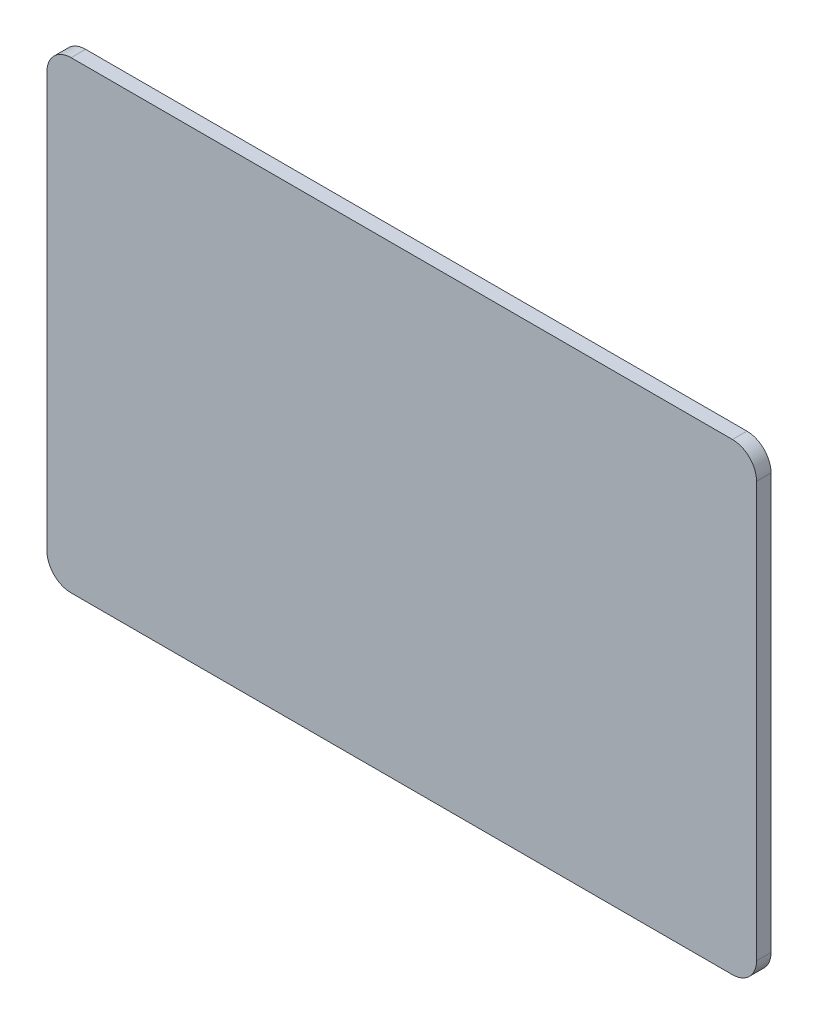
ISO-10303-21;
HEADER;
FILE_DESCRIPTION(('STEP AP214'),'2;1');
FILE_NAME('part.step','',(''),(''),'','','');
FILE_SCHEMA(('AUTOMOTIVE_DESIGN { 1 0 10303 214 1 1 1 1 }'));
ENDSEC;
DATA;
#1=APPLICATION_CONTEXT('core data for automotive mechanical design processes');
#2=APPLICATION_PROTOCOL_DEFINITION('international standard','automotive_design',2000,#1);
#3=PRODUCT_CONTEXT('',#1,'mechanical');
#4=PRODUCT('Part','Part','',(#3));
#5=PRODUCT_RELATED_PRODUCT_CATEGORY('part','',(#4));
#6=PRODUCT_DEFINITION_FORMATION('','',#4);
#7=PRODUCT_DEFINITION_CONTEXT('part definition',#1,'design');
#8=PRODUCT_DEFINITION('design','',#6,#7);
#9=PRODUCT_DEFINITION_SHAPE('','',#8);
#10=(LENGTH_UNIT() NAMED_UNIT(*) SI_UNIT(.MILLI.,.METRE.));
#11=(NAMED_UNIT(*) PLANE_ANGLE_UNIT() SI_UNIT($,.RADIAN.));
#12=(NAMED_UNIT(*) SI_UNIT($,.STERADIAN.) SOLID_ANGLE_UNIT());
#13=UNCERTAINTY_MEASURE_WITH_UNIT(LENGTH_MEASURE(1.E-05),#10,'distance_accuracy_value','');
#14=(GEOMETRIC_REPRESENTATION_CONTEXT(3) GLOBAL_UNCERTAINTY_ASSIGNED_CONTEXT((#13)) GLOBAL_UNIT_ASSIGNED_CONTEXT((#10,
#11,#12)) REPRESENTATION_CONTEXT('',''));
#15=CARTESIAN_POINT('',(0.,0.,0.));
#16=DIRECTION('',(0.,0.,1.));
#17=DIRECTION('',(1.,0.,0.));
#18=AXIS2_PLACEMENT_3D('',#15,#16,#17);
#19=CARTESIAN_POINT('',(293.974322668553,429.992677664877,0.));
#20=DIRECTION('',(0.,0.,-1.));
#21=DIRECTION('',(-1.,0.,0.));
#22=AXIS2_PLACEMENT_3D('',#19,#20,#21);
#23=PLANE('',#22);
#24=CARTESIAN_POINT('',(293.974322668553,429.992677664877,0.));
#25=DIRECTION('',(0.,0.,1.));
#26=DIRECTION('',(-1.,0.,0.));
#27=AXIS2_PLACEMENT_3D('',#24,#25,#26);
#28=CIRCLE('',#27,50.);
#29=CARTESIAN_POINT('',(343.974322668553,429.992677664876,0.));
#30=VERTEX_POINT('',#29);
#31=CARTESIAN_POINT('',(293.974322668553,479.992677664877,0.));
#32=VERTEX_POINT('',#31);
#33=EDGE_CURVE('E144',#30,#32,#28,.T.);
#34=ORIENTED_EDGE('',*,*,#33,.F.);
#35=DIRECTION('',(0.,1.,0.));
#36=VECTOR('',#35,1.);
#37=CARTESIAN_POINT('',(343.974322668553,429.992677664876,0.));
#38=LINE('',#37,#36);
#39=CARTESIAN_POINT('',(343.974322668553,-429.992677664877,0.));
#40=VERTEX_POINT('',#39);
#41=EDGE_CURVE('E92',#40,#30,#38,.T.);
#42=ORIENTED_EDGE('',*,*,#41,.F.);
#43=CARTESIAN_POINT('',(293.974322668553,-429.992677664877,0.));
#44=DIRECTION('',(0.,0.,1.));
#45=DIRECTION('',(1.,0.,0.));
#46=AXIS2_PLACEMENT_3D('',#43,#44,#45);
#47=CIRCLE('',#46,50.);
#48=CARTESIAN_POINT('',(293.974322668553,-479.992677664877,0.));
#49=VERTEX_POINT('',#48);
#50=EDGE_CURVE('E157',#49,#40,#47,.T.);
#51=ORIENTED_EDGE('',*,*,#50,.F.);
#52=DIRECTION('',(1.,0.,0.));
#53=VECTOR('',#52,1.);
#54=CARTESIAN_POINT('',(-1075.54837365518,-479.992677664877,0.));
#55=LINE('',#54,#53);
#56=CARTESIAN_POINT('',(-1075.54837365518,-479.992677664877,0.));
#57=VERTEX_POINT('',#56);
#58=EDGE_CURVE('E132',#57,#49,#55,.T.);
#59=ORIENTED_EDGE('',*,*,#58,.F.);
#60=CARTESIAN_POINT('',(-1075.54837365518,-429.992677664877,0.));
#61=DIRECTION('',(0.,0.,1.));
#62=DIRECTION('',(1.,0.,0.));
#63=AXIS2_PLACEMENT_3D('',#60,#61,#62);
#64=CIRCLE('',#63,50.);
#65=CARTESIAN_POINT('',(-1125.54837365518,-429.992677664876,0.));
#66=VERTEX_POINT('',#65);
#67=EDGE_CURVE('E154',#66,#57,#64,.T.);
#68=ORIENTED_EDGE('',*,*,#67,.F.);
#69=DIRECTION('',(0.,-1.,0.));
#70=VECTOR('',#69,1.);
#71=CARTESIAN_POINT('',(-1125.54837365518,429.992677664876,0.));
#72=LINE('',#71,#70);
#73=CARTESIAN_POINT('',(-1125.54837365518,429.992677664876,0.));
#74=VERTEX_POINT('',#73);
#75=EDGE_CURVE('E152',#74,#66,#72,.T.);
#76=ORIENTED_EDGE('',*,*,#75,.F.);
#77=CARTESIAN_POINT('',(-1075.54837365518,429.992677664877,0.));
#78=DIRECTION('',(0.,0.,1.));
#79=DIRECTION('',(1.,0.,0.));
#80=AXIS2_PLACEMENT_3D('',#77,#78,#79);
#81=CIRCLE('',#80,50.);
#82=CARTESIAN_POINT('',(-1075.54837365518,479.992677664877,0.));
#83=VERTEX_POINT('',#82);
#84=EDGE_CURVE('E150',#83,#74,#81,.T.);
#85=ORIENTED_EDGE('',*,*,#84,.F.);
#86=DIRECTION('',(-1.,0.,0.));
#87=VECTOR('',#86,1.);
#88=CARTESIAN_POINT('',(-1075.54837365518,479.992677664877,0.));
#89=LINE('',#88,#87);
#90=EDGE_CURVE('E147',#32,#83,#89,.T.);
#91=ORIENTED_EDGE('',*,*,#90,.F.);
#92=EDGE_LOOP('',(#34,#42,#51,#59,#68,#76,#85,#91));
#93=FACE_BOUND('',#92,.T.);
#94=DIRECTION('',(1.,0.,0.));
#95=VECTOR('',#94,1.);
#96=CARTESIAN_POINT('',(-510.,200.,0.));
#97=LINE('',#96,#95);
#98=CARTESIAN_POINT('',(-810.,200.,0.));
#99=VERTEX_POINT('',#98);
#100=CARTESIAN_POINT('',(-510.,200.,0.));
#101=VERTEX_POINT('',#100);
#102=EDGE_CURVE('E232',#99,#101,#97,.T.);
#103=ORIENTED_EDGE('',*,*,#102,.F.);
#104=CARTESIAN_POINT('',(-810.,150.,0.));
#105=DIRECTION('',(0.,0.,-1.));
#106=DIRECTION('',(1.,0.,0.));
#107=AXIS2_PLACEMENT_3D('',#104,#105,#106);
#108=CIRCLE('',#107,50.);
#109=CARTESIAN_POINT('',(-860.,150.,0.));
#110=VERTEX_POINT('',#109);
#111=EDGE_CURVE('E235',#110,#99,#108,.T.);
#112=ORIENTED_EDGE('',*,*,#111,.F.);
#113=DIRECTION('',(0.,1.,0.));
#114=VECTOR('',#113,1.);
#115=CARTESIAN_POINT('',(-860.,150.,0.));
#116=LINE('',#115,#114);
#117=CARTESIAN_POINT('',(-860.,-150.,0.));
#118=VERTEX_POINT('',#117);
#119=EDGE_CURVE('E215',#118,#110,#116,.T.);
#120=ORIENTED_EDGE('',*,*,#119,.F.);
#121=CARTESIAN_POINT('',(-810.,-150.,0.));
#122=DIRECTION('',(0.,0.,-1.));
#123=DIRECTION('',(-1.,0.,0.));
#124=AXIS2_PLACEMENT_3D('',#121,#122,#123);
#125=CIRCLE('',#124,50.0000000000001);
#126=CARTESIAN_POINT('',(-810.,-200.,0.));
#127=VERTEX_POINT('',#126);
#128=EDGE_CURVE('E218',#127,#118,#125,.T.);
#129=ORIENTED_EDGE('',*,*,#128,.F.);
#130=DIRECTION('',(-1.,0.,0.));
#131=VECTOR('',#130,1.);
#132=CARTESIAN_POINT('',(-510.,-200.,0.));
#133=LINE('',#132,#131);
#134=CARTESIAN_POINT('',(-510.,-200.,0.));
#135=VERTEX_POINT('',#134);
#136=EDGE_CURVE('E220',#135,#127,#133,.T.);
#137=ORIENTED_EDGE('',*,*,#136,.F.);
#138=CARTESIAN_POINT('',(-510.,-150.,0.));
#139=DIRECTION('',(0.,0.,-1.));
#140=DIRECTION('',(-1.,0.,0.));
#141=AXIS2_PLACEMENT_3D('',#138,#139,#140);
#142=CIRCLE('',#141,50.);
#143=CARTESIAN_POINT('',(-460.,-150.,0.));
#144=VERTEX_POINT('',#143);
#145=EDGE_CURVE('E223',#144,#135,#142,.T.);
#146=ORIENTED_EDGE('',*,*,#145,.F.);
#147=DIRECTION('',(0.,-1.,0.));
#148=VECTOR('',#147,1.);
#149=CARTESIAN_POINT('',(-460.,150.,0.));
#150=LINE('',#149,#148);
#151=CARTESIAN_POINT('',(-460.,150.,0.));
#152=VERTEX_POINT('',#151);
#153=EDGE_CURVE('E226',#152,#144,#150,.T.);
#154=ORIENTED_EDGE('',*,*,#153,.F.);
#155=CARTESIAN_POINT('',(-510.,150.,0.));
#156=DIRECTION('',(0.,0.,-1.));
#157=DIRECTION('',(-1.,0.,0.));
#158=AXIS2_PLACEMENT_3D('',#155,#156,#157);
#159=CIRCLE('',#158,50.);
#160=EDGE_CURVE('E229',#101,#152,#159,.T.);
#161=ORIENTED_EDGE('',*,*,#160,.F.);
#162=EDGE_LOOP('',(#103,#112,#120,#129,#137,#146,#154,#161));
#163=FACE_BOUND('',#162,.T.);
#164=ADVANCED_FACE('F35',(#93,#163),#23,.T.);
#165=CARTESIAN_POINT('',(293.974322668553,429.992677664877,30.));
#166=DIRECTION('',(0.,0.,-1.));
#167=DIRECTION('',(-1.,0.,0.));
#168=AXIS2_PLACEMENT_3D('',#165,#166,#167);
#169=CYLINDRICAL_SURFACE('',#168,50.);
#170=ORIENTED_EDGE('',*,*,#33,.T.);
#171=DIRECTION('',(0.,0.,-1.));
#172=VECTOR('',#171,1.);
#173=CARTESIAN_POINT('',(293.974322668553,479.992677664877,30.));
#174=LINE('',#173,#172);
#175=CARTESIAN_POINT('',(293.974322668553,479.992677664877,30.));
#176=VERTEX_POINT('',#175);
#177=EDGE_CURVE('E11',#176,#32,#174,.T.);
#178=ORIENTED_EDGE('',*,*,#177,.F.);
#179=CARTESIAN_POINT('',(293.974322668553,429.992677664877,30.));
#180=DIRECTION('',(0.,0.,1.));
#181=DIRECTION('',(-1.,0.,0.));
#182=AXIS2_PLACEMENT_3D('',#179,#180,#181);
#183=CIRCLE('',#182,50.);
#184=CARTESIAN_POINT('',(343.974322668553,429.992677664876,30.));
#185=VERTEX_POINT('',#184);
#186=EDGE_CURVE('E160',#185,#176,#183,.T.);
#187=ORIENTED_EDGE('',*,*,#186,.F.);
#188=DIRECTION('',(0.,0.,-1.));
#189=VECTOR('',#188,1.);
#190=CARTESIAN_POINT('',(343.974322668553,429.992677664876,30.));
#191=LINE('',#190,#189);
#192=EDGE_CURVE('E140',#185,#30,#191,.T.);
#193=ORIENTED_EDGE('',*,*,#192,.T.);
#194=EDGE_LOOP('',(#170,#178,#187,#193));
#195=FACE_BOUND('',#194,.T.);
#196=ADVANCED_FACE('F37',(#195),#169,.T.);
#197=CARTESIAN_POINT('',(-1075.54837365518,479.992677664877,30.));
#198=DIRECTION('',(0.,-1.,0.));
#199=DIRECTION('',(0.,0.,-1.));
#200=AXIS2_PLACEMENT_3D('',#197,#198,#199);
#201=PLANE('',#200);
#202=ORIENTED_EDGE('',*,*,#90,.T.);
#203=DIRECTION('',(0.,0.,-1.));
#204=VECTOR('',#203,1.);
#205=CARTESIAN_POINT('',(-1075.54837365518,479.992677664877,30.));
#206=LINE('',#205,#204);
#207=CARTESIAN_POINT('',(-1075.54837365518,479.992677664877,30.));
#208=VERTEX_POINT('',#207);
#209=EDGE_CURVE('E43',#208,#83,#206,.T.);
#210=ORIENTED_EDGE('',*,*,#209,.F.);
#211=DIRECTION('',(-1.,0.,0.));
#212=VECTOR('',#211,1.);
#213=CARTESIAN_POINT('',(-1075.54837365518,479.992677664877,30.));
#214=LINE('',#213,#212);
#215=EDGE_CURVE('E100',#176,#208,#214,.T.);
#216=ORIENTED_EDGE('',*,*,#215,.F.);
#217=ORIENTED_EDGE('',*,*,#177,.T.);
#218=EDGE_LOOP('',(#202,#210,#216,#217));
#219=FACE_BOUND('',#218,.T.);
#220=ADVANCED_FACE('F337',(#219),#201,.F.);
#221=CARTESIAN_POINT('',(-1075.54837365518,429.992677664877,30.));
#222=DIRECTION('',(0.,0.,-1.));
#223=DIRECTION('',(-1.,0.,0.));
#224=AXIS2_PLACEMENT_3D('',#221,#222,#223);
#225=CYLINDRICAL_SURFACE('',#224,50.);
#226=ORIENTED_EDGE('',*,*,#84,.T.);
#227=DIRECTION('',(0.,0.,-1.));
#228=VECTOR('',#227,1.);
#229=CARTESIAN_POINT('',(-1125.54837365518,429.992677664876,30.));
#230=LINE('',#229,#228);
#231=CARTESIAN_POINT('',(-1125.54837365518,429.992677664876,30.));
#232=VERTEX_POINT('',#231);
#233=EDGE_CURVE('E167',#232,#74,#230,.T.);
#234=ORIENTED_EDGE('',*,*,#233,.F.);
#235=CARTESIAN_POINT('',(-1075.54837365518,429.992677664877,30.));
#236=DIRECTION('',(0.,0.,1.));
#237=DIRECTION('',(1.,0.,0.));
#238=AXIS2_PLACEMENT_3D('',#235,#236,#237);
#239=CIRCLE('',#238,50.);
#240=EDGE_CURVE('E175',#208,#232,#239,.T.);
#241=ORIENTED_EDGE('',*,*,#240,.F.);
#242=ORIENTED_EDGE('',*,*,#209,.T.);
#243=EDGE_LOOP('',(#226,#234,#241,#242));
#244=FACE_BOUND('',#243,.T.);
#245=ADVANCED_FACE('F173',(#244),#225,.T.);
#246=CARTESIAN_POINT('',(-1125.54837365518,429.992677664876,30.));
#247=DIRECTION('',(1.,0.,0.));
#248=DIRECTION('',(0.,0.,-1.));
#249=AXIS2_PLACEMENT_3D('',#246,#247,#248);
#250=PLANE('',#249);
#251=ORIENTED_EDGE('',*,*,#75,.T.);
#252=DIRECTION('',(0.,0.,-1.));
#253=VECTOR('',#252,1.);
#254=CARTESIAN_POINT('',(-1125.54837365518,-429.992677664876,30.));
#255=LINE('',#254,#253);
#256=CARTESIAN_POINT('',(-1125.54837365518,-429.992677664876,30.));
#257=VERTEX_POINT('',#256);
#258=EDGE_CURVE('E164',#257,#66,#255,.T.);
#259=ORIENTED_EDGE('',*,*,#258,.F.);
#260=DIRECTION('',(0.,-1.,0.));
#261=VECTOR('',#260,1.);
#262=CARTESIAN_POINT('',(-1125.54837365518,429.992677664876,30.));
#263=LINE('',#262,#261);
#264=EDGE_CURVE('E187',#232,#257,#263,.T.);
#265=ORIENTED_EDGE('',*,*,#264,.F.);
#266=ORIENTED_EDGE('',*,*,#233,.T.);
#267=EDGE_LOOP('',(#251,#259,#265,#266));
#268=FACE_BOUND('',#267,.T.);
#269=ADVANCED_FACE('F183',(#268),#250,.F.);
#270=CARTESIAN_POINT('',(-1075.54837365518,-429.992677664877,30.));
#271=DIRECTION('',(0.,0.,-1.));
#272=DIRECTION('',(-1.,0.,0.));
#273=AXIS2_PLACEMENT_3D('',#270,#271,#272);
#274=CYLINDRICAL_SURFACE('',#273,50.);
#275=ORIENTED_EDGE('',*,*,#67,.T.);
#276=DIRECTION('',(0.,0.,-1.));
#277=VECTOR('',#276,1.);
#278=CARTESIAN_POINT('',(-1075.54837365518,-479.992677664877,30.));
#279=LINE('',#278,#277);
#280=CARTESIAN_POINT('',(-1075.54837365518,-479.992677664877,30.));
#281=VERTEX_POINT('',#280);
#282=EDGE_CURVE('E135',#281,#57,#279,.T.);
#283=ORIENTED_EDGE('',*,*,#282,.F.);
#284=CARTESIAN_POINT('',(-1075.54837365518,-429.992677664877,30.));
#285=DIRECTION('',(0.,0.,1.));
#286=DIRECTION('',(1.,0.,0.));
#287=AXIS2_PLACEMENT_3D('',#284,#285,#286);
#288=CIRCLE('',#287,50.);
#289=EDGE_CURVE('E123',#257,#281,#288,.T.);
#290=ORIENTED_EDGE('',*,*,#289,.F.);
#291=ORIENTED_EDGE('',*,*,#258,.T.);
#292=EDGE_LOOP('',(#275,#283,#290,#291));
#293=FACE_BOUND('',#292,.T.);
#294=ADVANCED_FACE('F186',(#293),#274,.T.);
#295=CARTESIAN_POINT('',(-1075.54837365518,-479.992677664877,30.));
#296=DIRECTION('',(0.,1.,0.));
#297=DIRECTION('',(0.,0.,1.));
#298=AXIS2_PLACEMENT_3D('',#295,#296,#297);
#299=PLANE('',#298);
#300=ORIENTED_EDGE('',*,*,#58,.T.);
#301=DIRECTION('',(0.,0.,-1.));
#302=VECTOR('',#301,1.);
#303=CARTESIAN_POINT('',(293.974322668553,-479.992677664877,30.));
#304=LINE('',#303,#302);
#305=CARTESIAN_POINT('',(293.974322668553,-479.992677664877,30.));
#306=VERTEX_POINT('',#305);
#307=EDGE_CURVE('E129',#306,#49,#304,.T.);
#308=ORIENTED_EDGE('',*,*,#307,.F.);
#309=DIRECTION('',(1.,0.,0.));
#310=VECTOR('',#309,1.);
#311=CARTESIAN_POINT('',(-1075.54837365518,-479.992677664877,30.));
#312=LINE('',#311,#310);
#313=EDGE_CURVE('E116',#281,#306,#312,.T.);
#314=ORIENTED_EDGE('',*,*,#313,.F.);
#315=ORIENTED_EDGE('',*,*,#282,.T.);
#316=EDGE_LOOP('',(#300,#308,#314,#315));
#317=FACE_BOUND('',#316,.T.);
#318=ADVANCED_FACE('F130',(#317),#299,.F.);
#319=CARTESIAN_POINT('',(293.974322668553,-429.992677664877,30.));
#320=DIRECTION('',(0.,0.,-1.));
#321=DIRECTION('',(-1.,0.,0.));
#322=AXIS2_PLACEMENT_3D('',#319,#320,#321);
#323=CYLINDRICAL_SURFACE('',#322,50.);
#324=ORIENTED_EDGE('',*,*,#50,.T.);
#325=DIRECTION('',(0.,0.,-1.));
#326=VECTOR('',#325,1.);
#327=CARTESIAN_POINT('',(343.974322668553,-429.992677664877,30.));
#328=LINE('',#327,#326);
#329=CARTESIAN_POINT('',(343.974322668553,-429.992677664877,30.));
#330=VERTEX_POINT('',#329);
#331=EDGE_CURVE('E136',#330,#40,#328,.T.);
#332=ORIENTED_EDGE('',*,*,#331,.F.);
#333=CARTESIAN_POINT('',(293.974322668553,-429.992677664877,30.));
#334=DIRECTION('',(0.,0.,1.));
#335=DIRECTION('',(1.,0.,0.));
#336=AXIS2_PLACEMENT_3D('',#333,#334,#335);
#337=CIRCLE('',#336,50.);
#338=EDGE_CURVE('E120',#306,#330,#337,.T.);
#339=ORIENTED_EDGE('',*,*,#338,.F.);
#340=ORIENTED_EDGE('',*,*,#307,.T.);
#341=EDGE_LOOP('',(#324,#332,#339,#340));
#342=FACE_BOUND('',#341,.T.);
#343=ADVANCED_FACE('F138',(#342),#323,.T.);
#344=CARTESIAN_POINT('',(343.974322668553,429.992677664876,30.));
#345=DIRECTION('',(-1.,0.,0.));
#346=DIRECTION('',(0.,0.,1.));
#347=AXIS2_PLACEMENT_3D('',#344,#345,#346);
#348=PLANE('',#347);
#349=ORIENTED_EDGE('',*,*,#41,.T.);
#350=ORIENTED_EDGE('',*,*,#192,.F.);
#351=DIRECTION('',(0.,1.,0.));
#352=VECTOR('',#351,1.);
#353=CARTESIAN_POINT('',(343.974322668553,429.992677664876,30.));
#354=LINE('',#353,#352);
#355=EDGE_CURVE('E59',#330,#185,#354,.T.);
#356=ORIENTED_EDGE('',*,*,#355,.F.);
#357=ORIENTED_EDGE('',*,*,#331,.T.);
#358=EDGE_LOOP('',(#349,#350,#356,#357));
#359=FACE_BOUND('',#358,.T.);
#360=ADVANCED_FACE('F342',(#359),#348,.F.);
#361=CARTESIAN_POINT('',(293.974322668553,429.992677664877,30.));
#362=DIRECTION('',(0.,0.,-1.));
#363=DIRECTION('',(-1.,0.,0.));
#364=AXIS2_PLACEMENT_3D('',#361,#362,#363);
#365=PLANE('',#364);
#366=ORIENTED_EDGE('',*,*,#186,.T.);
#367=ORIENTED_EDGE('',*,*,#215,.T.);
#368=ORIENTED_EDGE('',*,*,#240,.T.);
#369=ORIENTED_EDGE('',*,*,#264,.T.);
#370=ORIENTED_EDGE('',*,*,#289,.T.);
#371=ORIENTED_EDGE('',*,*,#313,.T.);
#372=ORIENTED_EDGE('',*,*,#338,.T.);
#373=ORIENTED_EDGE('',*,*,#355,.T.);
#374=EDGE_LOOP('',(#366,#367,#368,#369,#370,#371,#372,#373));
#375=FACE_BOUND('',#374,.T.);
#376=ADVANCED_FACE('F118',(#375),#365,.F.);
#377=CARTESIAN_POINT('',(-810.,150.,-100.));
#378=DIRECTION('',(0.,0.,1.));
#379=DIRECTION('',(1.,0.,0.));
#380=AXIS2_PLACEMENT_3D('',#377,#378,#379);
#381=CYLINDRICAL_SURFACE('',#380,50.);
#382=ORIENTED_EDGE('',*,*,#111,.T.);
#383=DIRECTION('',(0.,0.,1.));
#384=VECTOR('',#383,1.);
#385=CARTESIAN_POINT('',(-810.,200.,-100.));
#386=LINE('',#385,#384);
#387=CARTESIAN_POINT('',(-810.,200.,-100.));
#388=VERTEX_POINT('',#387);
#389=EDGE_CURVE('E148',#388,#99,#386,.T.);
#390=ORIENTED_EDGE('',*,*,#389,.F.);
#391=CARTESIAN_POINT('',(-810.,150.,-100.));
#392=DIRECTION('',(0.,0.,-1.));
#393=DIRECTION('',(1.,0.,0.));
#394=AXIS2_PLACEMENT_3D('',#391,#392,#393);
#395=CIRCLE('',#394,50.);
#396=CARTESIAN_POINT('',(-860.,150.,-100.));
#397=VERTEX_POINT('',#396);
#398=EDGE_CURVE('E217',#397,#388,#395,.T.);
#399=ORIENTED_EDGE('',*,*,#398,.F.);
#400=DIRECTION('',(0.,0.,1.));
#401=VECTOR('',#400,1.);
#402=CARTESIAN_POINT('',(-860.,150.,-100.));
#403=LINE('',#402,#401);
#404=EDGE_CURVE('E211',#397,#110,#403,.T.);
#405=ORIENTED_EDGE('',*,*,#404,.T.);
#406=EDGE_LOOP('',(#382,#390,#399,#405));
#407=FACE_BOUND('',#406,.T.);
#408=ADVANCED_FACE('F270',(#407),#381,.T.);
#409=CARTESIAN_POINT('',(-510.,200.,-100.));
#410=DIRECTION('',(0.,-1.,0.));
#411=DIRECTION('',(1.,0.,0.));
#412=AXIS2_PLACEMENT_3D('',#409,#410,#411);
#413=PLANE('',#412);
#414=ORIENTED_EDGE('',*,*,#102,.T.);
#415=DIRECTION('',(0.,0.,1.));
#416=VECTOR('',#415,1.);
#417=CARTESIAN_POINT('',(-510.,200.,-100.));
#418=LINE('',#417,#416);
#419=CARTESIAN_POINT('',(-510.,200.,-100.));
#420=VERTEX_POINT('',#419);
#421=EDGE_CURVE('E195',#420,#101,#418,.T.);
#422=ORIENTED_EDGE('',*,*,#421,.F.);
#423=DIRECTION('',(1.,0.,0.));
#424=VECTOR('',#423,1.);
#425=CARTESIAN_POINT('',(-510.,200.,-100.));
#426=LINE('',#425,#424);
#427=EDGE_CURVE('E255',#388,#420,#426,.T.);
#428=ORIENTED_EDGE('',*,*,#427,.F.);
#429=ORIENTED_EDGE('',*,*,#389,.T.);
#430=EDGE_LOOP('',(#414,#422,#428,#429));
#431=FACE_BOUND('',#430,.T.);
#432=ADVANCED_FACE('F275',(#431),#413,.F.);
#433=CARTESIAN_POINT('',(-510.,150.,-100.));
#434=DIRECTION('',(0.,0.,1.));
#435=DIRECTION('',(1.,0.,0.));
#436=AXIS2_PLACEMENT_3D('',#433,#434,#435);
#437=CYLINDRICAL_SURFACE('',#436,50.);
#438=ORIENTED_EDGE('',*,*,#160,.T.);
#439=DIRECTION('',(0.,0.,1.));
#440=VECTOR('',#439,1.);
#441=CARTESIAN_POINT('',(-460.,150.,-100.));
#442=LINE('',#441,#440);
#443=CARTESIAN_POINT('',(-460.,150.,-100.));
#444=VERTEX_POINT('',#443);
#445=EDGE_CURVE('E198',#444,#152,#442,.T.);
#446=ORIENTED_EDGE('',*,*,#445,.F.);
#447=CARTESIAN_POINT('',(-510.,150.,-100.));
#448=DIRECTION('',(0.,0.,-1.));
#449=DIRECTION('',(-1.,0.,0.));
#450=AXIS2_PLACEMENT_3D('',#447,#448,#449);
#451=CIRCLE('',#450,50.);
#452=EDGE_CURVE('E252',#420,#444,#451,.T.);
#453=ORIENTED_EDGE('',*,*,#452,.F.);
#454=ORIENTED_EDGE('',*,*,#421,.T.);
#455=EDGE_LOOP('',(#438,#446,#453,#454));
#456=FACE_BOUND('',#455,.T.);
#457=ADVANCED_FACE('F299',(#456),#437,.T.);
#458=CARTESIAN_POINT('',(-460.,150.,-100.));
#459=DIRECTION('',(-1.,0.,0.));
#460=DIRECTION('',(0.,-1.,0.));
#461=AXIS2_PLACEMENT_3D('',#458,#459,#460);
#462=PLANE('',#461);
#463=ORIENTED_EDGE('',*,*,#153,.T.);
#464=DIRECTION('',(0.,0.,1.));
#465=VECTOR('',#464,1.);
#466=CARTESIAN_POINT('',(-460.,-150.,-100.));
#467=LINE('',#466,#465);
#468=CARTESIAN_POINT('',(-460.,-150.,-100.));
#469=VERTEX_POINT('',#468);
#470=EDGE_CURVE('E201',#469,#144,#467,.T.);
#471=ORIENTED_EDGE('',*,*,#470,.F.);
#472=DIRECTION('',(0.,-1.,0.));
#473=VECTOR('',#472,1.);
#474=CARTESIAN_POINT('',(-460.,150.,-100.));
#475=LINE('',#474,#473);
#476=EDGE_CURVE('E249',#444,#469,#475,.T.);
#477=ORIENTED_EDGE('',*,*,#476,.F.);
#478=ORIENTED_EDGE('',*,*,#445,.T.);
#479=EDGE_LOOP('',(#463,#471,#477,#478));
#480=FACE_BOUND('',#479,.T.);
#481=ADVANCED_FACE('F304',(#480),#462,.F.);
#482=CARTESIAN_POINT('',(-510.,-150.,-100.));
#483=DIRECTION('',(0.,0.,1.));
#484=DIRECTION('',(1.,0.,0.));
#485=AXIS2_PLACEMENT_3D('',#482,#483,#484);
#486=CYLINDRICAL_SURFACE('',#485,50.);
#487=ORIENTED_EDGE('',*,*,#145,.T.);
#488=DIRECTION('',(0.,0.,1.));
#489=VECTOR('',#488,1.);
#490=CARTESIAN_POINT('',(-510.,-200.,-100.));
#491=LINE('',#490,#489);
#492=CARTESIAN_POINT('',(-510.,-200.,-100.));
#493=VERTEX_POINT('',#492);
#494=EDGE_CURVE('E204',#493,#135,#491,.T.);
#495=ORIENTED_EDGE('',*,*,#494,.F.);
#496=CARTESIAN_POINT('',(-510.,-150.,-100.));
#497=DIRECTION('',(0.,0.,-1.));
#498=DIRECTION('',(-1.,0.,0.));
#499=AXIS2_PLACEMENT_3D('',#496,#497,#498);
#500=CIRCLE('',#499,50.);
#501=EDGE_CURVE('E246',#469,#493,#500,.T.);
#502=ORIENTED_EDGE('',*,*,#501,.F.);
#503=ORIENTED_EDGE('',*,*,#470,.T.);
#504=EDGE_LOOP('',(#487,#495,#502,#503));
#505=FACE_BOUND('',#504,.T.);
#506=ADVANCED_FACE('F322',(#505),#486,.T.);
#507=CARTESIAN_POINT('',(-510.,-200.,-100.));
#508=DIRECTION('',(0.,1.,0.));
#509=DIRECTION('',(-1.,0.,0.));
#510=AXIS2_PLACEMENT_3D('',#507,#508,#509);
#511=PLANE('',#510);
#512=ORIENTED_EDGE('',*,*,#136,.T.);
#513=DIRECTION('',(0.,0.,1.));
#514=VECTOR('',#513,1.);
#515=CARTESIAN_POINT('',(-810.,-200.,-100.));
#516=LINE('',#515,#514);
#517=CARTESIAN_POINT('',(-810.,-200.,-100.));
#518=VERTEX_POINT('',#517);
#519=EDGE_CURVE('E207',#518,#127,#516,.T.);
#520=ORIENTED_EDGE('',*,*,#519,.F.);
#521=DIRECTION('',(-1.,0.,0.));
#522=VECTOR('',#521,1.);
#523=CARTESIAN_POINT('',(-510.,-200.,-100.));
#524=LINE('',#523,#522);
#525=EDGE_CURVE('E243',#493,#518,#524,.T.);
#526=ORIENTED_EDGE('',*,*,#525,.F.);
#527=ORIENTED_EDGE('',*,*,#494,.T.);
#528=EDGE_LOOP('',(#512,#520,#526,#527));
#529=FACE_BOUND('',#528,.T.);
#530=ADVANCED_FACE('F323',(#529),#511,.F.);
#531=CARTESIAN_POINT('',(-810.,-150.,-100.));
#532=DIRECTION('',(0.,0.,1.));
#533=DIRECTION('',(1.,0.,0.));
#534=AXIS2_PLACEMENT_3D('',#531,#532,#533);
#535=CYLINDRICAL_SURFACE('',#534,50.0000000000001);
#536=ORIENTED_EDGE('',*,*,#128,.T.);
#537=DIRECTION('',(0.,0.,1.));
#538=VECTOR('',#537,1.);
#539=CARTESIAN_POINT('',(-860.,-150.,-100.));
#540=LINE('',#539,#538);
#541=CARTESIAN_POINT('',(-860.,-150.,-100.));
#542=VERTEX_POINT('',#541);
#543=EDGE_CURVE('E50',#542,#118,#540,.T.);
#544=ORIENTED_EDGE('',*,*,#543,.F.);
#545=CARTESIAN_POINT('',(-810.,-150.,-100.));
#546=DIRECTION('',(0.,0.,-1.));
#547=DIRECTION('',(-1.,0.,0.));
#548=AXIS2_PLACEMENT_3D('',#545,#546,#547);
#549=CIRCLE('',#548,50.0000000000001);
#550=EDGE_CURVE('E240',#518,#542,#549,.T.);
#551=ORIENTED_EDGE('',*,*,#550,.F.);
#552=ORIENTED_EDGE('',*,*,#519,.T.);
#553=EDGE_LOOP('',(#536,#544,#551,#552));
#554=FACE_BOUND('',#553,.T.);
#555=ADVANCED_FACE('F320',(#554),#535,.T.);
#556=CARTESIAN_POINT('',(-860.,150.,-100.));
#557=DIRECTION('',(1.,0.,0.));
#558=DIRECTION('',(0.,1.,0.));
#559=AXIS2_PLACEMENT_3D('',#556,#557,#558);
#560=PLANE('',#559);
#561=ORIENTED_EDGE('',*,*,#119,.T.);
#562=ORIENTED_EDGE('',*,*,#404,.F.);
#563=DIRECTION('',(0.,1.,0.));
#564=VECTOR('',#563,1.);
#565=CARTESIAN_POINT('',(-860.,150.,-100.));
#566=LINE('',#565,#564);
#567=EDGE_CURVE('E214',#542,#397,#566,.T.);
#568=ORIENTED_EDGE('',*,*,#567,.F.);
#569=ORIENTED_EDGE('',*,*,#543,.T.);
#570=EDGE_LOOP('',(#561,#562,#568,#569));
#571=FACE_BOUND('',#570,.T.);
#572=ADVANCED_FACE('F292',(#571),#560,.F.);
#573=CARTESIAN_POINT('',(-810.,150.,-100.));
#574=DIRECTION('',(0.,0.,1.));
#575=DIRECTION('',(1.,0.,0.));
#576=AXIS2_PLACEMENT_3D('',#573,#574,#575);
#577=PLANE('',#576);
#578=ORIENTED_EDGE('',*,*,#398,.T.);
#579=ORIENTED_EDGE('',*,*,#427,.T.);
#580=ORIENTED_EDGE('',*,*,#452,.T.);
#581=ORIENTED_EDGE('',*,*,#476,.T.);
#582=ORIENTED_EDGE('',*,*,#501,.T.);
#583=ORIENTED_EDGE('',*,*,#525,.T.);
#584=ORIENTED_EDGE('',*,*,#550,.T.);
#585=ORIENTED_EDGE('',*,*,#567,.T.);
#586=EDGE_LOOP('',(#578,#579,#580,#581,#582,#583,#584,#585));
#587=FACE_BOUND('',#586,.T.);
#588=ADVANCED_FACE('F263',(#587),#577,.F.);
#589=CLOSED_SHELL('',(#164,#196,#220,#245,#269,#294,#318,#343,#360,#376,#408,#432,#457,#481,
#506,#530,#555,#572,#588));
#590=MANIFOLD_SOLID_BREP('B2',#589);
#591=ADVANCED_BREP_SHAPE_REPRESENTATION('',(#18,#590),#14);
#592=SHAPE_DEFINITION_REPRESENTATION(#9,#591);
ENDSEC;
END-ISO-10303-21;
